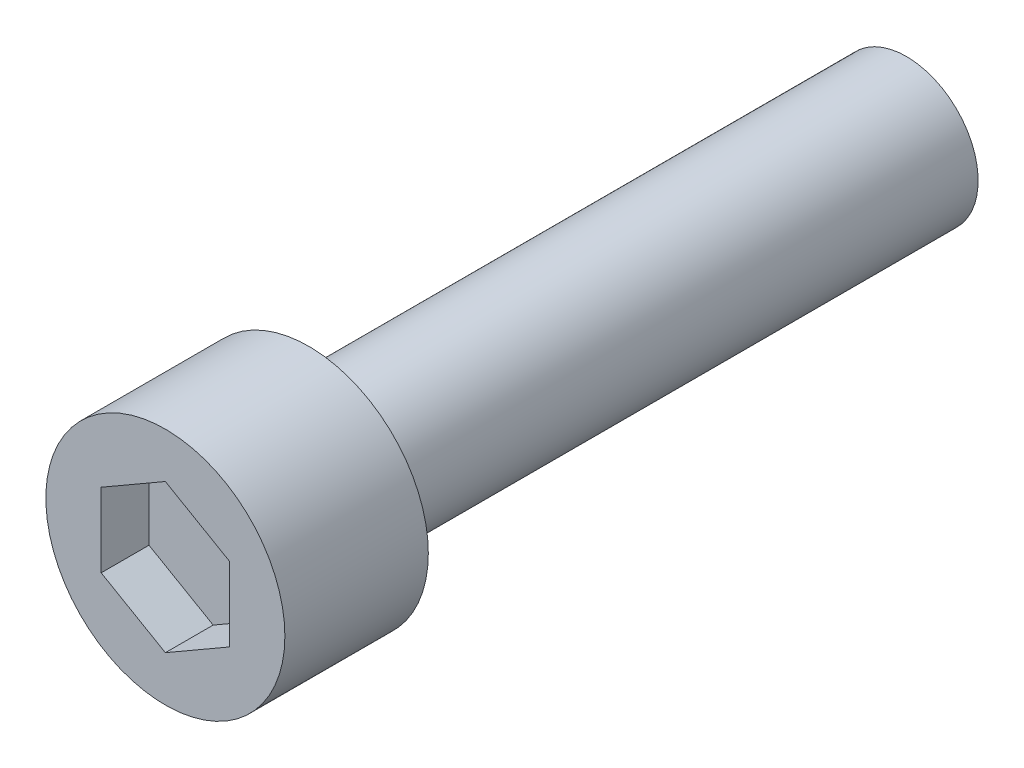
ISO-10303-21;
HEADER;
FILE_DESCRIPTION(('STEP AP214'),'2;1');
FILE_NAME('part.step','',(''),(''),'','','');
FILE_SCHEMA(('AUTOMOTIVE_DESIGN { 1 0 10303 214 1 1 1 1 }'));
ENDSEC;
DATA;
#1=APPLICATION_CONTEXT('core data for automotive mechanical design processes');
#2=APPLICATION_PROTOCOL_DEFINITION('international standard','automotive_design',2000,#1);
#3=PRODUCT_CONTEXT('',#1,'mechanical');
#4=PRODUCT('Part','Part','',(#3));
#5=PRODUCT_RELATED_PRODUCT_CATEGORY('part','',(#4));
#6=PRODUCT_DEFINITION_FORMATION('','',#4);
#7=PRODUCT_DEFINITION_CONTEXT('part definition',#1,'design');
#8=PRODUCT_DEFINITION('design','',#6,#7);
#9=PRODUCT_DEFINITION_SHAPE('','',#8);
#10=(LENGTH_UNIT() NAMED_UNIT(*) SI_UNIT(.MILLI.,.METRE.));
#11=(NAMED_UNIT(*) PLANE_ANGLE_UNIT() SI_UNIT($,.RADIAN.));
#12=(NAMED_UNIT(*) SI_UNIT($,.STERADIAN.) SOLID_ANGLE_UNIT());
#13=UNCERTAINTY_MEASURE_WITH_UNIT(LENGTH_MEASURE(1.E-05),#10,'distance_accuracy_value','');
#14=(GEOMETRIC_REPRESENTATION_CONTEXT(3) GLOBAL_UNCERTAINTY_ASSIGNED_CONTEXT((#13)) GLOBAL_UNIT_ASSIGNED_CONTEXT((#10,
#11,#12)) REPRESENTATION_CONTEXT('',''));
#15=CARTESIAN_POINT('',(0.,0.,0.));
#16=DIRECTION('',(0.,0.,1.));
#17=DIRECTION('',(1.,0.,0.));
#18=AXIS2_PLACEMENT_3D('',#15,#16,#17);
#19=CARTESIAN_POINT('',(0.,0.,4.));
#20=DIRECTION('',(0.,0.,1.));
#21=DIRECTION('',(1.,0.,0.));
#22=AXIS2_PLACEMENT_3D('',#19,#20,#21);
#23=PLANE('',#22);
#24=DIRECTION('',(0.866025403784439,0.5,0.));
#25=VECTOR('',#24,1.);
#26=CARTESIAN_POINT('',(2.68516980116154,-1.55028350752047,4.));
#27=LINE('',#26,#25);
#28=CARTESIAN_POINT('',(0.,-3.10056701504094,4.));
#29=VERTEX_POINT('',#28);
#30=CARTESIAN_POINT('',(2.68516980116154,-1.55028350752047,4.));
#31=VERTEX_POINT('',#30);
#32=EDGE_CURVE('E136',#29,#31,#27,.T.);
#33=ORIENTED_EDGE('',*,*,#32,.T.);
#34=DIRECTION('',(0.,1.,0.));
#35=VECTOR('',#34,1.);
#36=CARTESIAN_POINT('',(2.68516980116154,1.55028350752047,4.));
#37=LINE('',#36,#35);
#38=CARTESIAN_POINT('',(2.68516980116154,1.55028350752047,4.));
#39=VERTEX_POINT('',#38);
#40=EDGE_CURVE('E68',#31,#39,#37,.T.);
#41=ORIENTED_EDGE('',*,*,#40,.T.);
#42=DIRECTION('',(-0.866025403784439,0.5,0.));
#43=VECTOR('',#42,1.);
#44=CARTESIAN_POINT('',(0.,3.10056701504094,4.));
#45=LINE('',#44,#43);
#46=CARTESIAN_POINT('',(0.,3.10056701504094,4.));
#47=VERTEX_POINT('',#46);
#48=EDGE_CURVE('E70',#39,#47,#45,.T.);
#49=ORIENTED_EDGE('',*,*,#48,.T.);
#50=DIRECTION('',(-0.866025403784439,-0.5,0.));
#51=VECTOR('',#50,1.);
#52=CARTESIAN_POINT('',(-2.68516980116154,1.55028350752047,4.));
#53=LINE('',#52,#51);
#54=CARTESIAN_POINT('',(-2.68516980116154,1.55028350752047,4.));
#55=VERTEX_POINT('',#54);
#56=EDGE_CURVE('E72',#47,#55,#53,.T.);
#57=ORIENTED_EDGE('',*,*,#56,.T.);
#58=DIRECTION('',(0.,-1.,0.));
#59=VECTOR('',#58,1.);
#60=CARTESIAN_POINT('',(-2.68516980116154,-1.55028350752047,4.));
#61=LINE('',#60,#59);
#62=CARTESIAN_POINT('',(-2.68516980116154,-1.55028350752047,4.));
#63=VERTEX_POINT('',#62);
#64=EDGE_CURVE('E127',#55,#63,#61,.T.);
#65=ORIENTED_EDGE('',*,*,#64,.T.);
#66=DIRECTION('',(0.866025403784439,-0.5,0.));
#67=VECTOR('',#66,1.);
#68=CARTESIAN_POINT('',(0.,-3.10056701504094,4.));
#69=LINE('',#68,#67);
#70=EDGE_CURVE('E132',#63,#29,#69,.T.);
#71=ORIENTED_EDGE('',*,*,#70,.T.);
#72=EDGE_LOOP('',(#33,#41,#49,#57,#65,#71));
#73=FACE_BOUND('',#72,.T.);
#74=ADVANCED_FACE('F17',(#73),#23,.T.);
#75=CARTESIAN_POINT('',(-2.68516980116154,1.55028350752047,6.));
#76=DIRECTION('',(-0.5,0.866025403784439,0.));
#77=DIRECTION('',(-0.866025403784439,-0.5,0.));
#78=AXIS2_PLACEMENT_3D('',#75,#76,#77);
#79=PLANE('',#78);
#80=DIRECTION('',(0.,0.,1.));
#81=VECTOR('',#80,1.);
#82=CARTESIAN_POINT('',(-2.68516980116154,1.55028350752047,6.));
#83=LINE('',#82,#81);
#84=CARTESIAN_POINT('',(-2.68516980116154,1.55028350752047,6.));
#85=VERTEX_POINT('',#84);
#86=EDGE_CURVE('E83',#85,#55,#83,.F.);
#87=ORIENTED_EDGE('',*,*,#86,.T.);
#88=ORIENTED_EDGE('',*,*,#56,.F.);
#89=DIRECTION('',(0.,0.,1.));
#90=VECTOR('',#89,1.);
#91=CARTESIAN_POINT('',(0.,3.10056701504094,6.));
#92=LINE('',#91,#90);
#93=CARTESIAN_POINT('',(0.,3.10056701504094,6.));
#94=VERTEX_POINT('',#93);
#95=EDGE_CURVE('E77',#47,#94,#92,.T.);
#96=ORIENTED_EDGE('',*,*,#95,.T.);
#97=DIRECTION('',(0.866025403784438,0.5,0.));
#98=VECTOR('',#97,1.);
#99=CARTESIAN_POINT('',(-2.68516980116154,1.55028350752047,6.));
#100=LINE('',#99,#98);
#101=EDGE_CURVE('E124',#85,#94,#100,.T.);
#102=ORIENTED_EDGE('',*,*,#101,.F.);
#103=EDGE_LOOP('',(#87,#88,#96,#102));
#104=FACE_BOUND('',#103,.T.);
#105=ADVANCED_FACE('F80',(#104),#79,.F.);
#106=CARTESIAN_POINT('',(0.,3.10056701504094,6.));
#107=DIRECTION('',(0.5,0.866025403784439,0.));
#108=DIRECTION('',(-0.866025403784439,0.5,0.));
#109=AXIS2_PLACEMENT_3D('',#106,#107,#108);
#110=PLANE('',#109);
#111=ORIENTED_EDGE('',*,*,#95,.F.);
#112=ORIENTED_EDGE('',*,*,#48,.F.);
#113=DIRECTION('',(0.,0.,-1.));
#114=VECTOR('',#113,1.);
#115=CARTESIAN_POINT('',(2.68516980116154,1.55028350752047,6.));
#116=LINE('',#115,#114);
#117=CARTESIAN_POINT('',(2.68516980116154,1.55028350752047,6.));
#118=VERTEX_POINT('',#117);
#119=EDGE_CURVE('E91',#39,#118,#116,.F.);
#120=ORIENTED_EDGE('',*,*,#119,.T.);
#121=DIRECTION('',(0.866025403784438,-0.5,0.));
#122=VECTOR('',#121,1.);
#123=CARTESIAN_POINT('',(0.,3.10056701504094,6.));
#124=LINE('',#123,#122);
#125=EDGE_CURVE('E88',#94,#118,#124,.T.);
#126=ORIENTED_EDGE('',*,*,#125,.F.);
#127=EDGE_LOOP('',(#111,#112,#120,#126));
#128=FACE_BOUND('',#127,.T.);
#129=ADVANCED_FACE('F86',(#128),#110,.F.);
#130=CARTESIAN_POINT('',(2.68516980116154,1.55028350752047,6.));
#131=DIRECTION('',(1.,0.,0.));
#132=DIRECTION('',(0.,0.,-1.));
#133=AXIS2_PLACEMENT_3D('',#130,#131,#132);
#134=PLANE('',#133);
#135=ORIENTED_EDGE('',*,*,#119,.F.);
#136=ORIENTED_EDGE('',*,*,#40,.F.);
#137=DIRECTION('',(0.,0.,1.));
#138=VECTOR('',#137,1.);
#139=CARTESIAN_POINT('',(2.68516980116154,-1.55028350752047,6.));
#140=LINE('',#139,#138);
#141=CARTESIAN_POINT('',(2.68516980116154,-1.55028350752047,6.));
#142=VERTEX_POINT('',#141);
#143=EDGE_CURVE('E134',#31,#142,#140,.T.);
#144=ORIENTED_EDGE('',*,*,#143,.T.);
#145=DIRECTION('',(0.,1.,0.));
#146=VECTOR('',#145,1.);
#147=CARTESIAN_POINT('',(2.68516980116154,0.,6.));
#148=LINE('',#147,#146);
#149=EDGE_CURVE('E120',#118,#142,#148,.F.);
#150=ORIENTED_EDGE('',*,*,#149,.F.);
#151=EDGE_LOOP('',(#135,#136,#144,#150));
#152=FACE_BOUND('',#151,.T.);
#153=ADVANCED_FACE('F139',(#152),#134,.F.);
#154=CARTESIAN_POINT('',(2.68516980116154,-1.55028350752047,6.));
#155=DIRECTION('',(0.5,-0.866025403784439,0.));
#156=DIRECTION('',(0.866025403784439,0.5,0.));
#157=AXIS2_PLACEMENT_3D('',#154,#155,#156);
#158=PLANE('',#157);
#159=ORIENTED_EDGE('',*,*,#143,.F.);
#160=ORIENTED_EDGE('',*,*,#32,.F.);
#161=DIRECTION('',(0.,0.,1.));
#162=VECTOR('',#161,1.);
#163=CARTESIAN_POINT('',(0.,-3.10056701504094,6.));
#164=LINE('',#163,#162);
#165=CARTESIAN_POINT('',(0.,-3.10056701504094,6.));
#166=VERTEX_POINT('',#165);
#167=EDGE_CURVE('E130',#29,#166,#164,.T.);
#168=ORIENTED_EDGE('',*,*,#167,.T.);
#169=DIRECTION('',(-0.866025403784438,-0.5,0.));
#170=VECTOR('',#169,1.);
#171=CARTESIAN_POINT('',(2.68516980116154,-1.55028350752047,6.));
#172=LINE('',#171,#170);
#173=EDGE_CURVE('E115',#142,#166,#172,.T.);
#174=ORIENTED_EDGE('',*,*,#173,.F.);
#175=EDGE_LOOP('',(#159,#160,#168,#174));
#176=FACE_BOUND('',#175,.T.);
#177=ADVANCED_FACE('F150',(#176),#158,.F.);
#178=CARTESIAN_POINT('',(0.,-3.10056701504094,6.));
#179=DIRECTION('',(-0.5,-0.866025403784439,0.));
#180=DIRECTION('',(0.866025403784439,-0.5,0.));
#181=AXIS2_PLACEMENT_3D('',#178,#179,#180);
#182=PLANE('',#181);
#183=ORIENTED_EDGE('',*,*,#167,.F.);
#184=ORIENTED_EDGE('',*,*,#70,.F.);
#185=DIRECTION('',(0.,0.,1.));
#186=VECTOR('',#185,1.);
#187=CARTESIAN_POINT('',(-2.68516980116154,-1.55028350752047,6.));
#188=LINE('',#187,#186);
#189=CARTESIAN_POINT('',(-2.68516980116154,-1.55028350752047,6.));
#190=VERTEX_POINT('',#189);
#191=EDGE_CURVE('E35',#63,#190,#188,.T.);
#192=ORIENTED_EDGE('',*,*,#191,.T.);
#193=DIRECTION('',(-0.866025403784438,0.5,0.));
#194=VECTOR('',#193,1.);
#195=CARTESIAN_POINT('',(0.,-3.10056701504094,6.));
#196=LINE('',#195,#194);
#197=EDGE_CURVE('E111',#166,#190,#196,.T.);
#198=ORIENTED_EDGE('',*,*,#197,.F.);
#199=EDGE_LOOP('',(#183,#184,#192,#198));
#200=FACE_BOUND('',#199,.T.);
#201=ADVANCED_FACE('F148',(#200),#182,.F.);
#202=CARTESIAN_POINT('',(-2.68516980116154,-1.55028350752047,6.));
#203=DIRECTION('',(-1.,0.,0.));
#204=DIRECTION('',(0.,-1.,0.));
#205=AXIS2_PLACEMENT_3D('',#202,#203,#204);
#206=PLANE('',#205);
#207=ORIENTED_EDGE('',*,*,#191,.F.);
#208=ORIENTED_EDGE('',*,*,#64,.F.);
#209=ORIENTED_EDGE('',*,*,#86,.F.);
#210=DIRECTION('',(0.,1.,0.));
#211=VECTOR('',#210,1.);
#212=CARTESIAN_POINT('',(-2.68516980116154,0.,6.));
#213=LINE('',#212,#211);
#214=EDGE_CURVE('E107',#190,#85,#213,.T.);
#215=ORIENTED_EDGE('',*,*,#214,.F.);
#216=EDGE_LOOP('',(#207,#208,#209,#215));
#217=FACE_BOUND('',#216,.T.);
#218=ADVANCED_FACE('F145',(#217),#206,.F.);
#219=CARTESIAN_POINT('',(0.,0.,6.));
#220=DIRECTION('',(0.,0.,1.));
#221=DIRECTION('',(1.,0.,0.));
#222=AXIS2_PLACEMENT_3D('',#219,#220,#221);
#223=PLANE('',#222);
#224=ORIENTED_EDGE('',*,*,#197,.T.);
#225=ORIENTED_EDGE('',*,*,#214,.T.);
#226=ORIENTED_EDGE('',*,*,#101,.T.);
#227=ORIENTED_EDGE('',*,*,#125,.T.);
#228=ORIENTED_EDGE('',*,*,#149,.T.);
#229=ORIENTED_EDGE('',*,*,#173,.T.);
#230=EDGE_LOOP('',(#224,#225,#226,#227,#228,#229));
#231=FACE_BOUND('',#230,.T.);
#232=CARTESIAN_POINT('',(0.,0.,6.));
#233=DIRECTION('',(0.,0.,1.));
#234=DIRECTION('',(1.,0.,0.));
#235=AXIS2_PLACEMENT_3D('',#232,#233,#234);
#236=CIRCLE('',#235,5.);
#237=CARTESIAN_POINT('',(5.,0.,6.));
#238=VERTEX_POINT('',#237);
#239=EDGE_CURVE('E104',#238,#238,#236,.F.);
#240=ORIENTED_EDGE('',*,*,#239,.F.);
#241=EDGE_LOOP('',(#240));
#242=FACE_BOUND('',#241,.T.);
#243=ADVANCED_FACE('F142',(#231,#242),#223,.T.);
#244=CARTESIAN_POINT('',(0.,0.,0.));
#245=DIRECTION('',(0.,0.,1.));
#246=DIRECTION('',(1.,0.,0.));
#247=AXIS2_PLACEMENT_3D('',#244,#245,#246);
#248=CYLINDRICAL_SURFACE('',#247,5.);
#249=CARTESIAN_POINT('',(0.,0.,0.));
#250=DIRECTION('',(0.,0.,1.));
#251=DIRECTION('',(1.,0.,0.));
#252=AXIS2_PLACEMENT_3D('',#249,#250,#251);
#253=CIRCLE('',#252,5.);
#254=CARTESIAN_POINT('',(5.,0.,0.));
#255=VERTEX_POINT('',#254);
#256=EDGE_CURVE('E99',#255,#255,#253,.T.);
#257=ORIENTED_EDGE('',*,*,#256,.T.);
#258=EDGE_LOOP('',(#257));
#259=FACE_BOUND('',#258,.T.);
#260=ORIENTED_EDGE('',*,*,#239,.T.);
#261=EDGE_LOOP('',(#260));
#262=FACE_BOUND('',#261,.T.);
#263=ADVANCED_FACE('F175',(#259,#262),#248,.T.);
#264=CARTESIAN_POINT('',(0.,0.,-25.));
#265=DIRECTION('',(0.,0.,1.));
#266=DIRECTION('',(1.,0.,0.));
#267=AXIS2_PLACEMENT_3D('',#264,#265,#266);
#268=PLANE('',#267);
#269=CARTESIAN_POINT('',(0.,0.,-25.));
#270=DIRECTION('',(0.,0.,-1.));
#271=DIRECTION('',(-1.,0.,0.));
#272=AXIS2_PLACEMENT_3D('',#269,#270,#271);
#273=CIRCLE('',#272,3.);
#274=CARTESIAN_POINT('',(-3.,0.,-25.));
#275=VERTEX_POINT('',#274);
#276=EDGE_CURVE('E26',#275,#275,#273,.F.);
#277=ORIENTED_EDGE('',*,*,#276,.F.);
#278=EDGE_LOOP('',(#277));
#279=FACE_BOUND('',#278,.T.);
#280=ADVANCED_FACE('F168',(#279),#268,.F.);
#281=CARTESIAN_POINT('',(0.,0.,0.));
#282=DIRECTION('',(0.,0.,1.));
#283=DIRECTION('',(1.,0.,0.));
#284=AXIS2_PLACEMENT_3D('',#281,#282,#283);
#285=PLANE('',#284);
#286=CARTESIAN_POINT('',(0.,0.,0.));
#287=DIRECTION('',(0.,0.,-1.));
#288=DIRECTION('',(-1.,0.,0.));
#289=AXIS2_PLACEMENT_3D('',#286,#287,#288);
#290=CIRCLE('',#289,3.);
#291=CARTESIAN_POINT('',(-3.,0.,0.));
#292=VERTEX_POINT('',#291);
#293=EDGE_CURVE('E11',#292,#292,#290,.T.);
#294=ORIENTED_EDGE('',*,*,#293,.F.);
#295=EDGE_LOOP('',(#294));
#296=FACE_BOUND('',#295,.T.);
#297=ORIENTED_EDGE('',*,*,#256,.F.);
#298=EDGE_LOOP('',(#297));
#299=FACE_BOUND('',#298,.T.);
#300=ADVANCED_FACE('F162',(#296,#299),#285,.F.);
#301=CARTESIAN_POINT('',(0.,0.,0.));
#302=DIRECTION('',(0.,0.,-1.));
#303=DIRECTION('',(-1.,0.,0.));
#304=AXIS2_PLACEMENT_3D('',#301,#302,#303);
#305=CYLINDRICAL_SURFACE('',#304,3.);
#306=ORIENTED_EDGE('',*,*,#293,.T.);
#307=EDGE_LOOP('',(#306));
#308=FACE_BOUND('',#307,.T.);
#309=ORIENTED_EDGE('',*,*,#276,.T.);
#310=EDGE_LOOP('',(#309));
#311=FACE_BOUND('',#310,.T.);
#312=ADVANCED_FACE('F160',(#308,#311),#305,.T.);
#313=CLOSED_SHELL('',(#74,#105,#129,#153,#177,#201,#218,#243,#263,#280,#300,#312));
#314=MANIFOLD_SOLID_BREP('B1',#313);
#315=ADVANCED_BREP_SHAPE_REPRESENTATION('',(#18,#314),#14);
#316=SHAPE_DEFINITION_REPRESENTATION(#9,#315);
ENDSEC;
END-ISO-10303-21;
